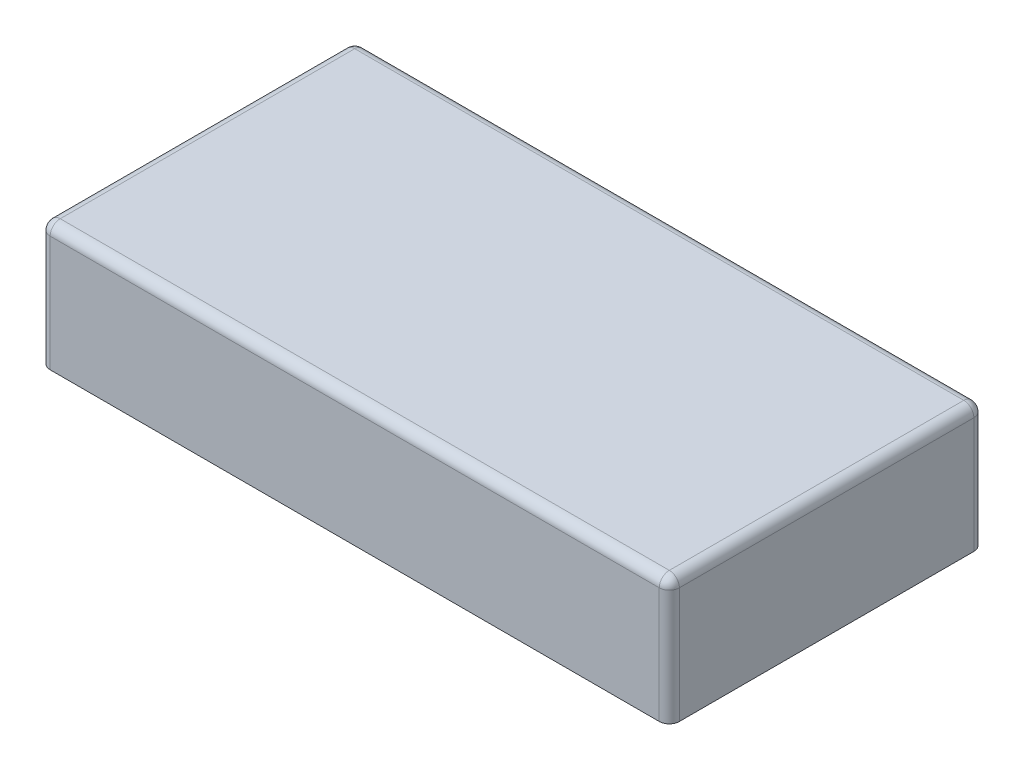
ISO-10303-21;
HEADER;
FILE_DESCRIPTION(('STEP AP214'),'2;1');
FILE_NAME('part.step','',(''),(''),'','','');
FILE_SCHEMA(('AUTOMOTIVE_DESIGN { 1 0 10303 214 1 1 1 1 }'));
ENDSEC;
DATA;
#1=APPLICATION_CONTEXT('core data for automotive mechanical design processes');
#2=APPLICATION_PROTOCOL_DEFINITION('international standard','automotive_design',2000,#1);
#3=PRODUCT_CONTEXT('',#1,'mechanical');
#4=PRODUCT('Part','Part','',(#3));
#5=PRODUCT_RELATED_PRODUCT_CATEGORY('part','',(#4));
#6=PRODUCT_DEFINITION_FORMATION('','',#4);
#7=PRODUCT_DEFINITION_CONTEXT('part definition',#1,'design');
#8=PRODUCT_DEFINITION('design','',#6,#7);
#9=PRODUCT_DEFINITION_SHAPE('','',#8);
#10=(LENGTH_UNIT() NAMED_UNIT(*) SI_UNIT(.MILLI.,.METRE.));
#11=(NAMED_UNIT(*) PLANE_ANGLE_UNIT() SI_UNIT($,.RADIAN.));
#12=(NAMED_UNIT(*) SI_UNIT($,.STERADIAN.) SOLID_ANGLE_UNIT());
#13=UNCERTAINTY_MEASURE_WITH_UNIT(LENGTH_MEASURE(1.E-05),#10,'distance_accuracy_value','');
#14=(GEOMETRIC_REPRESENTATION_CONTEXT(3) GLOBAL_UNCERTAINTY_ASSIGNED_CONTEXT((#13)) GLOBAL_UNIT_ASSIGNED_CONTEXT((#10,
#11,#12)) REPRESENTATION_CONTEXT('',''));
#15=CARTESIAN_POINT('',(0.,0.,0.));
#16=DIRECTION('',(0.,0.,1.));
#17=DIRECTION('',(1.,0.,0.));
#18=AXIS2_PLACEMENT_3D('',#15,#16,#17);
#19=CARTESIAN_POINT('',(0.,0.,0.));
#20=DIRECTION('',(0.,-1.,0.));
#21=DIRECTION('',(0.,0.,-1.));
#22=AXIS2_PLACEMENT_3D('',#19,#20,#21);
#23=PLANE('',#22);
#24=DIRECTION('',(0.,0.,1.));
#25=VECTOR('',#24,1.);
#26=CARTESIAN_POINT('',(-17.7331133805742,0.,-0.785891089108861));
#27=LINE('',#26,#25);
#28=CARTESIAN_POINT('',(-17.7331133805742,0.,-8.46939108910887));
#29=VERTEX_POINT('',#28);
#30=CARTESIAN_POINT('',(-17.7331133805742,0.,-1.03989108910886));
#31=VERTEX_POINT('',#30);
#32=EDGE_CURVE('E159',#29,#31,#27,.T.);
#33=ORIENTED_EDGE('',*,*,#32,.F.);
#34=CARTESIAN_POINT('',(-17.4791133805742,0.,-8.46939108910887));
#35=DIRECTION('',(0.,-1.,0.));
#36=DIRECTION('',(0.,0.,-1.));
#37=AXIS2_PLACEMENT_3D('',#34,#35,#36);
#38=CIRCLE('',#37,0.254);
#39=CARTESIAN_POINT('',(-17.4791133805742,0.,-8.72339108910887));
#40=VERTEX_POINT('',#39);
#41=EDGE_CURVE('E201',#29,#40,#38,.T.);
#42=ORIENTED_EDGE('',*,*,#41,.T.);
#43=DIRECTION('',(-1.,0.,0.));
#44=VECTOR('',#43,1.);
#45=CARTESIAN_POINT('',(-17.7331133805742,0.,-8.72339108910887));
#46=LINE('',#45,#44);
#47=CARTESIAN_POINT('',(-2.11211338057419,0.,-8.72339108910887));
#48=VERTEX_POINT('',#47);
#49=EDGE_CURVE('E185',#48,#40,#46,.T.);
#50=ORIENTED_EDGE('',*,*,#49,.F.);
#51=CARTESIAN_POINT('',(-2.11211338057419,0.,-8.46939108910887));
#52=DIRECTION('',(0.,-1.,0.));
#53=DIRECTION('',(0.,0.,-1.));
#54=AXIS2_PLACEMENT_3D('',#51,#52,#53);
#55=CIRCLE('',#54,0.254);
#56=CARTESIAN_POINT('',(-1.85811338057419,0.,-8.46939108910887));
#57=VERTEX_POINT('',#56);
#58=EDGE_CURVE('E199',#48,#57,#55,.T.);
#59=ORIENTED_EDGE('',*,*,#58,.T.);
#60=DIRECTION('',(0.,0.,-1.));
#61=VECTOR('',#60,1.);
#62=CARTESIAN_POINT('',(-1.85811338057419,0.,-8.72339108910887));
#63=LINE('',#62,#61);
#64=CARTESIAN_POINT('',(-1.85811338057419,0.,-1.03989108910886));
#65=VERTEX_POINT('',#64);
#66=EDGE_CURVE('E182',#65,#57,#63,.T.);
#67=ORIENTED_EDGE('',*,*,#66,.F.);
#68=CARTESIAN_POINT('',(-2.11211338057419,0.,-1.03989108910886));
#69=DIRECTION('',(0.,-1.,0.));
#70=DIRECTION('',(0.,0.,-1.));
#71=AXIS2_PLACEMENT_3D('',#68,#69,#70);
#72=CIRCLE('',#71,0.254);
#73=CARTESIAN_POINT('',(-2.11211338057419,0.,-0.785891089108864));
#74=VERTEX_POINT('',#73);
#75=EDGE_CURVE('E197',#65,#74,#72,.T.);
#76=ORIENTED_EDGE('',*,*,#75,.T.);
#77=DIRECTION('',(1.,0.,0.));
#78=VECTOR('',#77,1.);
#79=CARTESIAN_POINT('',(-1.85811338057419,0.,-0.785891089108864));
#80=LINE('',#79,#78);
#81=CARTESIAN_POINT('',(-17.4791133805742,0.,-0.785891089108861));
#82=VERTEX_POINT('',#81);
#83=EDGE_CURVE('E163',#82,#74,#80,.T.);
#84=ORIENTED_EDGE('',*,*,#83,.F.);
#85=CARTESIAN_POINT('',(-17.4791133805742,0.,-1.03989108910886));
#86=DIRECTION('',(0.,-1.,0.));
#87=DIRECTION('',(0.,0.,-1.));
#88=AXIS2_PLACEMENT_3D('',#85,#86,#87);
#89=CIRCLE('',#88,0.254);
#90=EDGE_CURVE('E195',#82,#31,#89,.T.);
#91=ORIENTED_EDGE('',*,*,#90,.T.);
#92=EDGE_LOOP('',(#33,#42,#50,#59,#67,#76,#84,#91));
#93=FACE_BOUND('',#92,.T.);
#94=DIRECTION('',(-1.,0.,0.));
#95=VECTOR('',#94,1.);
#96=CARTESIAN_POINT('',(0.,0.,-7.19939108910887));
#97=LINE('',#96,#95);
#98=CARTESIAN_POINT('',(-3.38211338057419,0.,-7.19939108910887));
#99=VERTEX_POINT('',#98);
#100=CARTESIAN_POINT('',(-16.2091133805742,0.,-7.19939108910887));
#101=VERTEX_POINT('',#100);
#102=EDGE_CURVE('E154',#99,#101,#97,.T.);
#103=ORIENTED_EDGE('',*,*,#102,.T.);
#104=DIRECTION('',(0.,0.,1.));
#105=VECTOR('',#104,1.);
#106=CARTESIAN_POINT('',(-16.2091133805742,0.,0.));
#107=LINE('',#106,#105);
#108=CARTESIAN_POINT('',(-16.2091133805742,0.,-2.30989108910886));
#109=VERTEX_POINT('',#108);
#110=EDGE_CURVE('E173',#101,#109,#107,.T.);
#111=ORIENTED_EDGE('',*,*,#110,.T.);
#112=DIRECTION('',(1.,0.,0.));
#113=VECTOR('',#112,1.);
#114=CARTESIAN_POINT('',(0.,0.,-2.30989108910886));
#115=LINE('',#114,#113);
#116=CARTESIAN_POINT('',(-3.38211338057419,0.,-2.30989108910886));
#117=VERTEX_POINT('',#116);
#118=EDGE_CURVE('E158',#109,#117,#115,.T.);
#119=ORIENTED_EDGE('',*,*,#118,.T.);
#120=DIRECTION('',(0.,0.,-1.));
#121=VECTOR('',#120,1.);
#122=CARTESIAN_POINT('',(-3.38211338057419,0.,0.));
#123=LINE('',#122,#121);
#124=EDGE_CURVE('E177',#117,#99,#123,.T.);
#125=ORIENTED_EDGE('',*,*,#124,.T.);
#126=EDGE_LOOP('',(#103,#111,#119,#125));
#127=FACE_BOUND('',#126,.T.);
#128=ADVANCED_FACE('F35',(#93,#127),#23,.T.);
#129=CARTESIAN_POINT('',(-17.7331133805742,3.175,-0.785891089108861));
#130=DIRECTION('',(1.,0.,0.));
#131=DIRECTION('',(0.,0.,-1.));
#132=AXIS2_PLACEMENT_3D('',#129,#130,#131);
#133=PLANE('',#132);
#134=DIRECTION('',(0.,0.,1.));
#135=VECTOR('',#134,1.);
#136=CARTESIAN_POINT('',(-17.7331133805742,2.921,-0.785891089108861));
#137=LINE('',#136,#135);
#138=CARTESIAN_POINT('',(-17.7331133805742,2.921,-1.03989108910886));
#139=VERTEX_POINT('',#138);
#140=CARTESIAN_POINT('',(-17.7331133805742,2.921,-8.46939108910887));
#141=VERTEX_POINT('',#140);
#142=EDGE_CURVE('E188',#139,#141,#137,.F.);
#143=ORIENTED_EDGE('',*,*,#142,.T.);
#144=DIRECTION('',(0.,-1.,0.));
#145=VECTOR('',#144,1.);
#146=CARTESIAN_POINT('',(-17.7331133805742,3.175,-8.46939108910887));
#147=LINE('',#146,#145);
#148=EDGE_CURVE('E192',#141,#29,#147,.T.);
#149=ORIENTED_EDGE('',*,*,#148,.T.);
#150=ORIENTED_EDGE('',*,*,#32,.T.);
#151=DIRECTION('',(0.,-1.,0.));
#152=VECTOR('',#151,1.);
#153=CARTESIAN_POINT('',(-17.7331133805742,3.175,-1.03989108910886));
#154=LINE('',#153,#152);
#155=EDGE_CURVE('E190',#31,#139,#154,.F.);
#156=ORIENTED_EDGE('',*,*,#155,.T.);
#157=EDGE_LOOP('',(#143,#149,#150,#156));
#158=FACE_BOUND('',#157,.T.);
#159=ADVANCED_FACE('F305',(#158),#133,.F.);
#160=CARTESIAN_POINT('',(-1.85811338057419,3.175,-0.785891089108864));
#161=DIRECTION('',(0.,0.,-1.));
#162=DIRECTION('',(-1.,0.,0.));
#163=AXIS2_PLACEMENT_3D('',#160,#161,#162);
#164=PLANE('',#163);
#165=ORIENTED_EDGE('',*,*,#83,.T.);
#166=DIRECTION('',(0.,-1.,0.));
#167=VECTOR('',#166,1.);
#168=CARTESIAN_POINT('',(-2.11211338057419,3.175,-0.785891089108864));
#169=LINE('',#168,#167);
#170=CARTESIAN_POINT('',(-2.11211338057419,2.921,-0.785891089108864));
#171=VERTEX_POINT('',#170);
#172=EDGE_CURVE('E11',#74,#171,#169,.F.);
#173=ORIENTED_EDGE('',*,*,#172,.T.);
#174=DIRECTION('',(1.,0.,0.));
#175=VECTOR('',#174,1.);
#176=CARTESIAN_POINT('',(-1.85811338057419,2.921,-0.785891089108864));
#177=LINE('',#176,#175);
#178=CARTESIAN_POINT('',(-17.4791133805742,2.921,-0.785891089108861));
#179=VERTEX_POINT('',#178);
#180=EDGE_CURVE('E44',#171,#179,#177,.F.);
#181=ORIENTED_EDGE('',*,*,#180,.T.);
#182=DIRECTION('',(0.,-1.,0.));
#183=VECTOR('',#182,1.);
#184=CARTESIAN_POINT('',(-17.4791133805742,3.175,-0.785891089108861));
#185=LINE('',#184,#183);
#186=EDGE_CURVE('E224',#179,#82,#185,.T.);
#187=ORIENTED_EDGE('',*,*,#186,.T.);
#188=EDGE_LOOP('',(#165,#173,#181,#187));
#189=FACE_BOUND('',#188,.T.);
#190=ADVANCED_FACE('F303',(#189),#164,.F.);
#191=CARTESIAN_POINT('',(-1.85811338057419,3.175,-8.72339108910887));
#192=DIRECTION('',(-1.,0.,0.));
#193=DIRECTION('',(0.,0.,1.));
#194=AXIS2_PLACEMENT_3D('',#191,#192,#193);
#195=PLANE('',#194);
#196=ORIENTED_EDGE('',*,*,#66,.T.);
#197=DIRECTION('',(0.,-1.,0.));
#198=VECTOR('',#197,1.);
#199=CARTESIAN_POINT('',(-1.85811338057419,3.175,-8.46939108910887));
#200=LINE('',#199,#198);
#201=CARTESIAN_POINT('',(-1.85811338057419,2.921,-8.46939108910887));
#202=VERTEX_POINT('',#201);
#203=EDGE_CURVE('E222',#57,#202,#200,.F.);
#204=ORIENTED_EDGE('',*,*,#203,.T.);
#205=DIRECTION('',(0.,0.,-1.));
#206=VECTOR('',#205,1.);
#207=CARTESIAN_POINT('',(-1.85811338057419,2.921,-8.72339108910887));
#208=LINE('',#207,#206);
#209=CARTESIAN_POINT('',(-1.85811338057419,2.921,-1.03989108910886));
#210=VERTEX_POINT('',#209);
#211=EDGE_CURVE('E220',#202,#210,#208,.F.);
#212=ORIENTED_EDGE('',*,*,#211,.T.);
#213=DIRECTION('',(0.,-1.,0.));
#214=VECTOR('',#213,1.);
#215=CARTESIAN_POINT('',(-1.85811338057419,3.175,-1.03989108910886));
#216=LINE('',#215,#214);
#217=EDGE_CURVE('E218',#210,#65,#216,.T.);
#218=ORIENTED_EDGE('',*,*,#217,.T.);
#219=EDGE_LOOP('',(#196,#204,#212,#218));
#220=FACE_BOUND('',#219,.T.);
#221=ADVANCED_FACE('F271',(#220),#195,.F.);
#222=CARTESIAN_POINT('',(-17.7331133805742,3.175,-8.72339108910887));
#223=DIRECTION('',(0.,0.,1.));
#224=DIRECTION('',(1.,0.,0.));
#225=AXIS2_PLACEMENT_3D('',#222,#223,#224);
#226=PLANE('',#225);
#227=ORIENTED_EDGE('',*,*,#49,.T.);
#228=DIRECTION('',(0.,-1.,0.));
#229=VECTOR('',#228,1.);
#230=CARTESIAN_POINT('',(-17.4791133805742,3.175,-8.72339108910887));
#231=LINE('',#230,#229);
#232=CARTESIAN_POINT('',(-17.4791133805742,2.921,-8.72339108910887));
#233=VERTEX_POINT('',#232);
#234=EDGE_CURVE('E207',#40,#233,#231,.F.);
#235=ORIENTED_EDGE('',*,*,#234,.T.);
#236=DIRECTION('',(-1.,0.,0.));
#237=VECTOR('',#236,1.);
#238=CARTESIAN_POINT('',(-17.7331133805742,2.921,-8.72339108910887));
#239=LINE('',#238,#237);
#240=CARTESIAN_POINT('',(-2.11211338057419,2.921,-8.72339108910887));
#241=VERTEX_POINT('',#240);
#242=EDGE_CURVE('E203',#233,#241,#239,.F.);
#243=ORIENTED_EDGE('',*,*,#242,.T.);
#244=DIRECTION('',(0.,-1.,0.));
#245=VECTOR('',#244,1.);
#246=CARTESIAN_POINT('',(-2.11211338057419,3.175,-8.72339108910887));
#247=LINE('',#246,#245);
#248=EDGE_CURVE('E205',#241,#48,#247,.T.);
#249=ORIENTED_EDGE('',*,*,#248,.T.);
#250=EDGE_LOOP('',(#227,#235,#243,#249));
#251=FACE_BOUND('',#250,.T.);
#252=ADVANCED_FACE('F313',(#251),#226,.F.);
#253=CARTESIAN_POINT('',(0.,3.175,0.));
#254=DIRECTION('',(0.,-1.,0.));
#255=DIRECTION('',(0.,0.,-1.));
#256=AXIS2_PLACEMENT_3D('',#253,#254,#255);
#257=PLANE('',#256);
#258=DIRECTION('',(1.,0.,0.));
#259=VECTOR('',#258,1.);
#260=CARTESIAN_POINT('',(0.,3.175,-1.03989108910886));
#261=LINE('',#260,#259);
#262=CARTESIAN_POINT('',(-17.4791133805742,3.175,-1.03989108910886));
#263=VERTEX_POINT('',#262);
#264=CARTESIAN_POINT('',(-2.11211338057419,3.175,-1.03989108910886));
#265=VERTEX_POINT('',#264);
#266=EDGE_CURVE('E213',#263,#265,#261,.T.);
#267=ORIENTED_EDGE('',*,*,#266,.T.);
#268=DIRECTION('',(0.,0.,-1.));
#269=VECTOR('',#268,1.);
#270=CARTESIAN_POINT('',(-2.11211338057419,3.175,0.));
#271=LINE('',#270,#269);
#272=CARTESIAN_POINT('',(-2.11211338057419,3.175,-8.46939108910887));
#273=VERTEX_POINT('',#272);
#274=EDGE_CURVE('E215',#265,#273,#271,.T.);
#275=ORIENTED_EDGE('',*,*,#274,.T.);
#276=DIRECTION('',(-1.,0.,0.));
#277=VECTOR('',#276,1.);
#278=CARTESIAN_POINT('',(0.,3.175,-8.46939108910887));
#279=LINE('',#278,#277);
#280=CARTESIAN_POINT('',(-17.4791133805742,3.175,-8.46939108910887));
#281=VERTEX_POINT('',#280);
#282=EDGE_CURVE('E209',#273,#281,#279,.T.);
#283=ORIENTED_EDGE('',*,*,#282,.T.);
#284=DIRECTION('',(0.,0.,1.));
#285=VECTOR('',#284,1.);
#286=CARTESIAN_POINT('',(-17.4791133805742,3.175,0.));
#287=LINE('',#286,#285);
#288=EDGE_CURVE('E211',#281,#263,#287,.T.);
#289=ORIENTED_EDGE('',*,*,#288,.T.);
#290=EDGE_LOOP('',(#267,#275,#283,#289));
#291=FACE_BOUND('',#290,.T.);
#292=ADVANCED_FACE('F288',(#291),#257,.F.);
#293=CARTESIAN_POINT('',(-16.2091133805742,3.175,-0.785891089108861));
#294=DIRECTION('',(1.,0.,0.));
#295=DIRECTION('',(0.,0.,-1.));
#296=AXIS2_PLACEMENT_3D('',#293,#294,#295);
#297=PLANE('',#296);
#298=ORIENTED_EDGE('',*,*,#110,.F.);
#299=DIRECTION('',(0.,-1.,0.));
#300=VECTOR('',#299,1.);
#301=CARTESIAN_POINT('',(-16.2091133805742,3.175,-7.19939108910887));
#302=LINE('',#301,#300);
#303=CARTESIAN_POINT('',(-16.2091133805742,1.651,-7.19939108910887));
#304=VERTEX_POINT('',#303);
#305=EDGE_CURVE('E153',#304,#101,#302,.T.);
#306=ORIENTED_EDGE('',*,*,#305,.F.);
#307=DIRECTION('',(0.,0.,1.));
#308=VECTOR('',#307,1.);
#309=CARTESIAN_POINT('',(-16.2091133805742,1.651,0.));
#310=LINE('',#309,#308);
#311=CARTESIAN_POINT('',(-16.2091133805742,1.651,-2.30989108910886));
#312=VERTEX_POINT('',#311);
#313=EDGE_CURVE('E139',#304,#312,#310,.T.);
#314=ORIENTED_EDGE('',*,*,#313,.T.);
#315=DIRECTION('',(0.,-1.,0.));
#316=VECTOR('',#315,1.);
#317=CARTESIAN_POINT('',(-16.2091133805742,3.175,-2.30989108910886));
#318=LINE('',#317,#316);
#319=EDGE_CURVE('E151',#312,#109,#318,.T.);
#320=ORIENTED_EDGE('',*,*,#319,.T.);
#321=EDGE_LOOP('',(#298,#306,#314,#320));
#322=FACE_BOUND('',#321,.T.);
#323=ADVANCED_FACE('F150',(#322),#297,.T.);
#324=CARTESIAN_POINT('',(-1.85811338057419,3.175,-2.30989108910886));
#325=DIRECTION('',(0.,0.,-1.));
#326=DIRECTION('',(-1.,0.,0.));
#327=AXIS2_PLACEMENT_3D('',#324,#325,#326);
#328=PLANE('',#327);
#329=ORIENTED_EDGE('',*,*,#118,.F.);
#330=ORIENTED_EDGE('',*,*,#319,.F.);
#331=DIRECTION('',(1.,0.,0.));
#332=VECTOR('',#331,1.);
#333=CARTESIAN_POINT('',(0.,1.651,-2.30989108910886));
#334=LINE('',#333,#332);
#335=CARTESIAN_POINT('',(-3.38211338057419,1.651,-2.30989108910886));
#336=VERTEX_POINT('',#335);
#337=EDGE_CURVE('E135',#312,#336,#334,.T.);
#338=ORIENTED_EDGE('',*,*,#337,.T.);
#339=DIRECTION('',(0.,-1.,0.));
#340=VECTOR('',#339,1.);
#341=CARTESIAN_POINT('',(-3.38211338057419,3.175,-2.30989108910886));
#342=LINE('',#341,#340);
#343=EDGE_CURVE('E160',#336,#117,#342,.T.);
#344=ORIENTED_EDGE('',*,*,#343,.T.);
#345=EDGE_LOOP('',(#329,#330,#338,#344));
#346=FACE_BOUND('',#345,.T.);
#347=ADVANCED_FACE('F156',(#346),#328,.T.);
#348=CARTESIAN_POINT('',(-3.38211338057419,3.175,-8.72339108910887));
#349=DIRECTION('',(-1.,0.,0.));
#350=DIRECTION('',(0.,0.,1.));
#351=AXIS2_PLACEMENT_3D('',#348,#349,#350);
#352=PLANE('',#351);
#353=ORIENTED_EDGE('',*,*,#124,.F.);
#354=ORIENTED_EDGE('',*,*,#343,.F.);
#355=DIRECTION('',(0.,0.,-1.));
#356=VECTOR('',#355,1.);
#357=CARTESIAN_POINT('',(-3.38211338057419,1.651,0.));
#358=LINE('',#357,#356);
#359=CARTESIAN_POINT('',(-3.38211338057419,1.651,-7.19939108910887));
#360=VERTEX_POINT('',#359);
#361=EDGE_CURVE('E140',#336,#360,#358,.T.);
#362=ORIENTED_EDGE('',*,*,#361,.T.);
#363=DIRECTION('',(0.,-1.,0.));
#364=VECTOR('',#363,1.);
#365=CARTESIAN_POINT('',(-3.38211338057419,3.175,-7.19939108910887));
#366=LINE('',#365,#364);
#367=EDGE_CURVE('E165',#360,#99,#366,.T.);
#368=ORIENTED_EDGE('',*,*,#367,.T.);
#369=EDGE_LOOP('',(#353,#354,#362,#368));
#370=FACE_BOUND('',#369,.T.);
#371=ADVANCED_FACE('F479',(#370),#352,.T.);
#372=CARTESIAN_POINT('',(-17.7331133805742,3.175,-7.19939108910887));
#373=DIRECTION('',(0.,0.,1.));
#374=DIRECTION('',(1.,0.,0.));
#375=AXIS2_PLACEMENT_3D('',#372,#373,#374);
#376=PLANE('',#375);
#377=ORIENTED_EDGE('',*,*,#102,.F.);
#378=ORIENTED_EDGE('',*,*,#367,.F.);
#379=DIRECTION('',(-1.,0.,0.));
#380=VECTOR('',#379,1.);
#381=CARTESIAN_POINT('',(0.,1.651,-7.19939108910887));
#382=LINE('',#381,#380);
#383=EDGE_CURVE('E168',#360,#304,#382,.T.);
#384=ORIENTED_EDGE('',*,*,#383,.T.);
#385=ORIENTED_EDGE('',*,*,#305,.T.);
#386=EDGE_LOOP('',(#377,#378,#384,#385));
#387=FACE_BOUND('',#386,.T.);
#388=ADVANCED_FACE('F471',(#387),#376,.T.);
#389=CARTESIAN_POINT('',(0.,1.651,0.));
#390=DIRECTION('',(0.,-1.,0.));
#391=DIRECTION('',(0.,0.,-1.));
#392=AXIS2_PLACEMENT_3D('',#389,#390,#391);
#393=PLANE('',#392);
#394=ORIENTED_EDGE('',*,*,#313,.F.);
#395=ORIENTED_EDGE('',*,*,#383,.F.);
#396=ORIENTED_EDGE('',*,*,#361,.F.);
#397=ORIENTED_EDGE('',*,*,#337,.F.);
#398=EDGE_LOOP('',(#394,#395,#396,#397));
#399=FACE_BOUND('',#398,.T.);
#400=ADVANCED_FACE('F137',(#399),#393,.T.);
#401=CARTESIAN_POINT('',(-2.11211338057419,3.175,-1.03989108910886));
#402=DIRECTION('',(0.,-1.,0.));
#403=DIRECTION('',(0.,0.,-1.));
#404=AXIS2_PLACEMENT_3D('',#401,#402,#403);
#405=CYLINDRICAL_SURFACE('',#404,0.254);
#406=CARTESIAN_POINT('',(-2.11211338057419,2.921,-1.03989108910886));
#407=DIRECTION('',(0.,1.,0.));
#408=DIRECTION('',(0.,0.,1.));
#409=AXIS2_PLACEMENT_3D('',#406,#407,#408);
#410=CIRCLE('',#409,0.254);
#411=EDGE_CURVE('E39',#171,#210,#410,.T.);
#412=ORIENTED_EDGE('',*,*,#411,.F.);
#413=ORIENTED_EDGE('',*,*,#172,.F.);
#414=ORIENTED_EDGE('',*,*,#75,.F.);
#415=ORIENTED_EDGE('',*,*,#217,.F.);
#416=EDGE_LOOP('',(#412,#413,#414,#415));
#417=FACE_BOUND('',#416,.T.);
#418=ADVANCED_FACE('F37',(#417),#405,.T.);
#419=CARTESIAN_POINT('',(-2.11211338057419,2.921,-1.03989108910886));
#420=DIRECTION('',(0.,0.,1.));
#421=DIRECTION('',(1.,0.,0.));
#422=AXIS2_PLACEMENT_3D('',#419,#420,#421);
#423=SPHERICAL_SURFACE('',#422,0.254);
#424=CARTESIAN_POINT('',(-2.11211338057419,2.921,-1.03989108910886));
#425=DIRECTION('',(1.,0.,0.));
#426=DIRECTION('',(0.,0.,-1.));
#427=AXIS2_PLACEMENT_3D('',#424,#425,#426);
#428=CIRCLE('',#427,0.254);
#429=EDGE_CURVE('E254',#171,#265,#428,.F.);
#430=ORIENTED_EDGE('',*,*,#429,.F.);
#431=ORIENTED_EDGE('',*,*,#411,.T.);
#432=CARTESIAN_POINT('',(-2.11211338057419,2.921,-1.03989108910886));
#433=DIRECTION('',(0.,0.,1.));
#434=DIRECTION('',(1.,0.,0.));
#435=AXIS2_PLACEMENT_3D('',#432,#433,#434);
#436=CIRCLE('',#435,0.254);
#437=EDGE_CURVE('E256',#265,#210,#436,.F.);
#438=ORIENTED_EDGE('',*,*,#437,.F.);
#439=EDGE_LOOP('',(#430,#431,#438));
#440=FACE_BOUND('',#439,.T.);
#441=ADVANCED_FACE('F265',(#440),#423,.T.);
#442=CARTESIAN_POINT('',(-2.11211338057419,3.175,-8.46939108910887));
#443=DIRECTION('',(0.,-1.,0.));
#444=DIRECTION('',(0.,0.,-1.));
#445=AXIS2_PLACEMENT_3D('',#442,#443,#444);
#446=CYLINDRICAL_SURFACE('',#445,0.254);
#447=ORIENTED_EDGE('',*,*,#58,.F.);
#448=ORIENTED_EDGE('',*,*,#248,.F.);
#449=CARTESIAN_POINT('',(-2.11211338057419,2.921,-8.46939108910887));
#450=DIRECTION('',(0.,1.,0.));
#451=DIRECTION('',(0.,0.,1.));
#452=AXIS2_PLACEMENT_3D('',#449,#450,#451);
#453=CIRCLE('',#452,0.254);
#454=EDGE_CURVE('E251',#202,#241,#453,.T.);
#455=ORIENTED_EDGE('',*,*,#454,.F.);
#456=ORIENTED_EDGE('',*,*,#203,.F.);
#457=EDGE_LOOP('',(#447,#448,#455,#456));
#458=FACE_BOUND('',#457,.T.);
#459=ADVANCED_FACE('F281',(#458),#446,.T.);
#460=CARTESIAN_POINT('',(-2.11211338057419,2.921,0.));
#461=DIRECTION('',(0.,0.,-1.));
#462=DIRECTION('',(-1.,0.,0.));
#463=AXIS2_PLACEMENT_3D('',#460,#461,#462);
#464=CYLINDRICAL_SURFACE('',#463,0.254);
#465=ORIENTED_EDGE('',*,*,#437,.T.);
#466=ORIENTED_EDGE('',*,*,#211,.F.);
#467=CARTESIAN_POINT('',(-2.11211338057419,2.921,-8.46939108910887));
#468=DIRECTION('',(0.,0.,-1.));
#469=DIRECTION('',(-1.,0.,0.));
#470=AXIS2_PLACEMENT_3D('',#467,#468,#469);
#471=CIRCLE('',#470,0.254);
#472=EDGE_CURVE('E248',#273,#202,#471,.T.);
#473=ORIENTED_EDGE('',*,*,#472,.F.);
#474=ORIENTED_EDGE('',*,*,#274,.F.);
#475=EDGE_LOOP('',(#465,#466,#473,#474));
#476=FACE_BOUND('',#475,.T.);
#477=ADVANCED_FACE('F284',(#476),#464,.T.);
#478=CARTESIAN_POINT('',(0.,2.921,-1.03989108910886));
#479=DIRECTION('',(1.,0.,0.));
#480=DIRECTION('',(0.,0.,-1.));
#481=AXIS2_PLACEMENT_3D('',#478,#479,#480);
#482=CYLINDRICAL_SURFACE('',#481,0.254);
#483=ORIENTED_EDGE('',*,*,#429,.T.);
#484=ORIENTED_EDGE('',*,*,#266,.F.);
#485=CARTESIAN_POINT('',(-17.4791133805742,2.921,-1.03989108910886));
#486=DIRECTION('',(-1.,0.,0.));
#487=DIRECTION('',(0.,0.,1.));
#488=AXIS2_PLACEMENT_3D('',#485,#486,#487);
#489=CIRCLE('',#488,0.254);
#490=EDGE_CURVE('E245',#179,#263,#489,.T.);
#491=ORIENTED_EDGE('',*,*,#490,.F.);
#492=ORIENTED_EDGE('',*,*,#180,.F.);
#493=EDGE_LOOP('',(#483,#484,#491,#492));
#494=FACE_BOUND('',#493,.T.);
#495=ADVANCED_FACE('F293',(#494),#482,.T.);
#496=CARTESIAN_POINT('',(-17.4791133805742,3.175,-1.03989108910886));
#497=DIRECTION('',(0.,-1.,0.));
#498=DIRECTION('',(0.,0.,-1.));
#499=AXIS2_PLACEMENT_3D('',#496,#497,#498);
#500=CYLINDRICAL_SURFACE('',#499,0.254);
#501=ORIENTED_EDGE('',*,*,#90,.F.);
#502=ORIENTED_EDGE('',*,*,#186,.F.);
#503=CARTESIAN_POINT('',(-17.4791133805742,2.921,-1.03989108910886));
#504=DIRECTION('',(0.,1.,0.));
#505=DIRECTION('',(0.,0.,1.));
#506=AXIS2_PLACEMENT_3D('',#503,#504,#505);
#507=CIRCLE('',#506,0.254);
#508=EDGE_CURVE('E242',#139,#179,#507,.T.);
#509=ORIENTED_EDGE('',*,*,#508,.F.);
#510=ORIENTED_EDGE('',*,*,#155,.F.);
#511=EDGE_LOOP('',(#501,#502,#509,#510));
#512=FACE_BOUND('',#511,.T.);
#513=ADVANCED_FACE('F302',(#512),#500,.T.);
#514=CARTESIAN_POINT('',(-2.11211338057419,2.921,-8.46939108910887));
#515=DIRECTION('',(0.,0.,1.));
#516=DIRECTION('',(1.,0.,0.));
#517=AXIS2_PLACEMENT_3D('',#514,#515,#516);
#518=SPHERICAL_SURFACE('',#517,0.254);
#519=ORIENTED_EDGE('',*,*,#472,.T.);
#520=ORIENTED_EDGE('',*,*,#454,.T.);
#521=CARTESIAN_POINT('',(-2.11211338057419,2.921,-8.46939108910887));
#522=DIRECTION('',(1.,0.,0.));
#523=DIRECTION('',(0.,1.,0.));
#524=AXIS2_PLACEMENT_3D('',#521,#522,#523);
#525=CIRCLE('',#524,0.254);
#526=EDGE_CURVE('E239',#273,#241,#525,.F.);
#527=ORIENTED_EDGE('',*,*,#526,.F.);
#528=EDGE_LOOP('',(#519,#520,#527));
#529=FACE_BOUND('',#528,.T.);
#530=ADVANCED_FACE('F371',(#529),#518,.T.);
#531=CARTESIAN_POINT('',(-17.4791133805742,2.921,-1.03989108910886));
#532=DIRECTION('',(0.,0.,1.));
#533=DIRECTION('',(1.,0.,0.));
#534=AXIS2_PLACEMENT_3D('',#531,#532,#533);
#535=SPHERICAL_SURFACE('',#534,0.254);
#536=ORIENTED_EDGE('',*,*,#508,.T.);
#537=ORIENTED_EDGE('',*,*,#490,.T.);
#538=CARTESIAN_POINT('',(-17.4791133805742,2.921,-1.03989108910886));
#539=DIRECTION('',(0.,0.,1.));
#540=DIRECTION('',(1.,0.,0.));
#541=AXIS2_PLACEMENT_3D('',#538,#539,#540);
#542=CIRCLE('',#541,0.254);
#543=EDGE_CURVE('E236',#139,#263,#542,.F.);
#544=ORIENTED_EDGE('',*,*,#543,.F.);
#545=EDGE_LOOP('',(#536,#537,#544));
#546=FACE_BOUND('',#545,.T.);
#547=ADVANCED_FACE('F297',(#546),#535,.T.);
#548=CARTESIAN_POINT('',(0.,2.921,-8.46939108910887));
#549=DIRECTION('',(-1.,0.,0.));
#550=DIRECTION('',(0.,0.,1.));
#551=AXIS2_PLACEMENT_3D('',#548,#549,#550);
#552=CYLINDRICAL_SURFACE('',#551,0.254);
#553=ORIENTED_EDGE('',*,*,#526,.T.);
#554=ORIENTED_EDGE('',*,*,#242,.F.);
#555=CARTESIAN_POINT('',(-17.4791133805742,2.921,-8.46939108910887));
#556=DIRECTION('',(-1.,0.,0.));
#557=DIRECTION('',(0.,0.,1.));
#558=AXIS2_PLACEMENT_3D('',#555,#556,#557);
#559=CIRCLE('',#558,0.254);
#560=EDGE_CURVE('E233',#281,#233,#559,.T.);
#561=ORIENTED_EDGE('',*,*,#560,.F.);
#562=ORIENTED_EDGE('',*,*,#282,.F.);
#563=EDGE_LOOP('',(#553,#554,#561,#562));
#564=FACE_BOUND('',#563,.T.);
#565=ADVANCED_FACE('F317',(#564),#552,.T.);
#566=CARTESIAN_POINT('',(-17.4791133805742,2.921,0.));
#567=DIRECTION('',(0.,0.,1.));
#568=DIRECTION('',(1.,0.,0.));
#569=AXIS2_PLACEMENT_3D('',#566,#567,#568);
#570=CYLINDRICAL_SURFACE('',#569,0.254);
#571=ORIENTED_EDGE('',*,*,#543,.T.);
#572=ORIENTED_EDGE('',*,*,#288,.F.);
#573=CARTESIAN_POINT('',(-17.4791133805742,2.921,-8.46939108910887));
#574=DIRECTION('',(0.,0.,-1.));
#575=DIRECTION('',(-1.,0.,0.));
#576=AXIS2_PLACEMENT_3D('',#573,#574,#575);
#577=CIRCLE('',#576,0.254);
#578=EDGE_CURVE('E230',#141,#281,#577,.T.);
#579=ORIENTED_EDGE('',*,*,#578,.F.);
#580=ORIENTED_EDGE('',*,*,#142,.F.);
#581=EDGE_LOOP('',(#571,#572,#579,#580));
#582=FACE_BOUND('',#581,.T.);
#583=ADVANCED_FACE('F321',(#582),#570,.T.);
#584=CARTESIAN_POINT('',(-17.4791133805742,2.921,-8.46939108910887));
#585=DIRECTION('',(0.,0.,1.));
#586=DIRECTION('',(1.,0.,0.));
#587=AXIS2_PLACEMENT_3D('',#584,#585,#586);
#588=SPHERICAL_SURFACE('',#587,0.254);
#589=ORIENTED_EDGE('',*,*,#578,.T.);
#590=ORIENTED_EDGE('',*,*,#560,.T.);
#591=CARTESIAN_POINT('',(-17.4791133805742,2.921,-8.46939108910887));
#592=DIRECTION('',(0.,1.,0.));
#593=DIRECTION('',(0.,0.,1.));
#594=AXIS2_PLACEMENT_3D('',#591,#592,#593);
#595=CIRCLE('',#594,0.254);
#596=EDGE_CURVE('E227',#141,#233,#595,.F.);
#597=ORIENTED_EDGE('',*,*,#596,.F.);
#598=EDGE_LOOP('',(#589,#590,#597));
#599=FACE_BOUND('',#598,.T.);
#600=ADVANCED_FACE('F319',(#599),#588,.T.);
#601=CARTESIAN_POINT('',(-17.4791133805742,3.175,-8.46939108910887));
#602=DIRECTION('',(0.,-1.,0.));
#603=DIRECTION('',(0.,0.,-1.));
#604=AXIS2_PLACEMENT_3D('',#601,#602,#603);
#605=CYLINDRICAL_SURFACE('',#604,0.254);
#606=ORIENTED_EDGE('',*,*,#596,.T.);
#607=ORIENTED_EDGE('',*,*,#234,.F.);
#608=ORIENTED_EDGE('',*,*,#41,.F.);
#609=ORIENTED_EDGE('',*,*,#148,.F.);
#610=EDGE_LOOP('',(#606,#607,#608,#609));
#611=FACE_BOUND('',#610,.T.);
#612=ADVANCED_FACE('F309',(#611),#605,.T.);
#613=CLOSED_SHELL('',(#128,#159,#190,#221,#252,#292,#323,#347,#371,#388,#400,#418,#441,#459,
#477,#495,#513,#530,#547,#565,#583,#600,#612));
#614=MANIFOLD_SOLID_BREP('B2',#613);
#615=ADVANCED_BREP_SHAPE_REPRESENTATION('',(#18,#614),#14);
#616=SHAPE_DEFINITION_REPRESENTATION(#9,#615);
ENDSEC;
END-ISO-10303-21;
